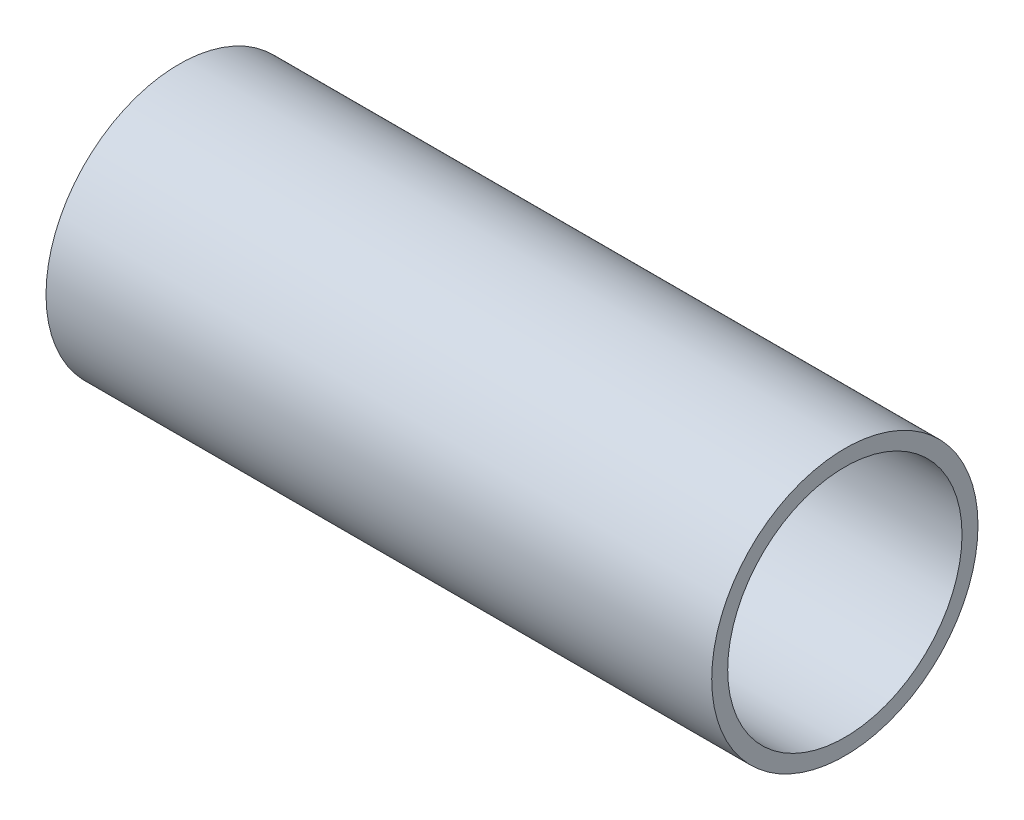
ISO-10303-21;
HEADER;
FILE_DESCRIPTION(('STEP AP214'),'2;1');
FILE_NAME('part.step','',(''),(''),'','','');
FILE_SCHEMA(('AUTOMOTIVE_DESIGN { 1 0 10303 214 1 1 1 1 }'));
ENDSEC;
DATA;
#1=APPLICATION_CONTEXT('core data for automotive mechanical design processes');
#2=APPLICATION_PROTOCOL_DEFINITION('international standard','automotive_design',2000,#1);
#3=PRODUCT_CONTEXT('',#1,'mechanical');
#4=PRODUCT('Part','Part','',(#3));
#5=PRODUCT_RELATED_PRODUCT_CATEGORY('part','',(#4));
#6=PRODUCT_DEFINITION_FORMATION('','',#4);
#7=PRODUCT_DEFINITION_CONTEXT('part definition',#1,'design');
#8=PRODUCT_DEFINITION('design','',#6,#7);
#9=PRODUCT_DEFINITION_SHAPE('','',#8);
#10=(LENGTH_UNIT() NAMED_UNIT(*) SI_UNIT(.MILLI.,.METRE.));
#11=(NAMED_UNIT(*) PLANE_ANGLE_UNIT() SI_UNIT($,.RADIAN.));
#12=(NAMED_UNIT(*) SI_UNIT($,.STERADIAN.) SOLID_ANGLE_UNIT());
#13=UNCERTAINTY_MEASURE_WITH_UNIT(LENGTH_MEASURE(1.E-05),#10,'distance_accuracy_value','');
#14=(GEOMETRIC_REPRESENTATION_CONTEXT(3) GLOBAL_UNCERTAINTY_ASSIGNED_CONTEXT((#13)) GLOBAL_UNIT_ASSIGNED_CONTEXT((#10,
#11,#12)) REPRESENTATION_CONTEXT('',''));
#15=CARTESIAN_POINT('',(0.,0.,0.));
#16=DIRECTION('',(0.,0.,1.));
#17=DIRECTION('',(1.,0.,0.));
#18=AXIS2_PLACEMENT_3D('',#15,#16,#17);
#19=CARTESIAN_POINT('',(125.,0.,1.39662974228741));
#20=DIRECTION('',(1.,0.,0.));
#21=DIRECTION('',(0.,0.,-1.));
#22=AXIS2_PLACEMENT_3D('',#19,#20,#21);
#23=PLANE('',#22);
#24=CARTESIAN_POINT('',(125.,0.,1.39662974228741));
#25=DIRECTION('',(1.,0.,0.));
#26=DIRECTION('',(0.,0.,-1.));
#27=AXIS2_PLACEMENT_3D('',#24,#25,#26);
#28=CIRCLE('',#27,25.);
#29=CARTESIAN_POINT('',(125.,0.,-23.6033702577126));
#30=VERTEX_POINT('',#29);
#31=EDGE_CURVE('E10',#30,#30,#28,.T.);
#32=ORIENTED_EDGE('',*,*,#31,.T.);
#33=EDGE_LOOP('',(#32));
#34=FACE_BOUND('',#33,.T.);
#35=CARTESIAN_POINT('',(125.,0.,1.39662974228741));
#36=DIRECTION('',(1.,0.,0.));
#37=DIRECTION('',(0.,0.,-1.));
#38=AXIS2_PLACEMENT_3D('',#35,#36,#37);
#39=CIRCLE('',#38,22.);
#40=CARTESIAN_POINT('',(125.,0.,-20.6033702577126));
#41=VERTEX_POINT('',#40);
#42=EDGE_CURVE('E42',#41,#41,#39,.T.);
#43=ORIENTED_EDGE('',*,*,#42,.F.);
#44=EDGE_LOOP('',(#43));
#45=FACE_BOUND('',#44,.T.);
#46=ADVANCED_FACE('F31',(#34,#45),#23,.T.);
#47=CARTESIAN_POINT('',(0.,0.,1.39662974228741));
#48=DIRECTION('',(1.,0.,0.));
#49=DIRECTION('',(0.,0.,-1.));
#50=AXIS2_PLACEMENT_3D('',#47,#48,#49);
#51=PLANE('',#50);
#52=CARTESIAN_POINT('',(0.,0.,1.39662974228741));
#53=DIRECTION('',(1.,0.,0.));
#54=DIRECTION('',(0.,0.,-1.));
#55=AXIS2_PLACEMENT_3D('',#52,#53,#54);
#56=CIRCLE('',#55,25.);
#57=CARTESIAN_POINT('',(0.,0.,-23.6033702577126));
#58=VERTEX_POINT('',#57);
#59=EDGE_CURVE('E35',#58,#58,#56,.T.);
#60=ORIENTED_EDGE('',*,*,#59,.F.);
#61=EDGE_LOOP('',(#60));
#62=FACE_BOUND('',#61,.T.);
#63=CARTESIAN_POINT('',(0.,0.,1.39662974228741));
#64=DIRECTION('',(1.,0.,0.));
#65=DIRECTION('',(0.,0.,-1.));
#66=AXIS2_PLACEMENT_3D('',#63,#64,#65);
#67=CIRCLE('',#66,22.);
#68=CARTESIAN_POINT('',(0.,0.,-20.6033702577126));
#69=VERTEX_POINT('',#68);
#70=EDGE_CURVE('E44',#69,#69,#67,.T.);
#71=ORIENTED_EDGE('',*,*,#70,.T.);
#72=EDGE_LOOP('',(#71));
#73=FACE_BOUND('',#72,.T.);
#74=ADVANCED_FACE('F54',(#62,#73),#51,.F.);
#75=CARTESIAN_POINT('',(125.,0.,1.39662974228741));
#76=DIRECTION('',(-1.,0.,0.));
#77=DIRECTION('',(0.,0.,1.));
#78=AXIS2_PLACEMENT_3D('',#75,#76,#77);
#79=CYLINDRICAL_SURFACE('',#78,25.);
#80=ORIENTED_EDGE('',*,*,#31,.F.);
#81=EDGE_LOOP('',(#80));
#82=FACE_BOUND('',#81,.T.);
#83=ORIENTED_EDGE('',*,*,#59,.T.);
#84=EDGE_LOOP('',(#83));
#85=FACE_BOUND('',#84,.T.);
#86=ADVANCED_FACE('F33',(#82,#85),#79,.T.);
#87=CARTESIAN_POINT('',(125.,0.,1.39662974228741));
#88=DIRECTION('',(-1.,0.,0.));
#89=DIRECTION('',(0.,0.,1.));
#90=AXIS2_PLACEMENT_3D('',#87,#88,#89);
#91=CYLINDRICAL_SURFACE('',#90,22.);
#92=ORIENTED_EDGE('',*,*,#42,.T.);
#93=EDGE_LOOP('',(#92));
#94=FACE_BOUND('',#93,.T.);
#95=ORIENTED_EDGE('',*,*,#70,.F.);
#96=EDGE_LOOP('',(#95));
#97=FACE_BOUND('',#96,.T.);
#98=ADVANCED_FACE('F50',(#94,#97),#91,.F.);
#99=CLOSED_SHELL('',(#46,#74,#86,#98));
#100=MANIFOLD_SOLID_BREP('B2',#99);
#101=ADVANCED_BREP_SHAPE_REPRESENTATION('',(#18,#100),#14);
#102=SHAPE_DEFINITION_REPRESENTATION(#9,#101);
ENDSEC;
END-ISO-10303-21;
